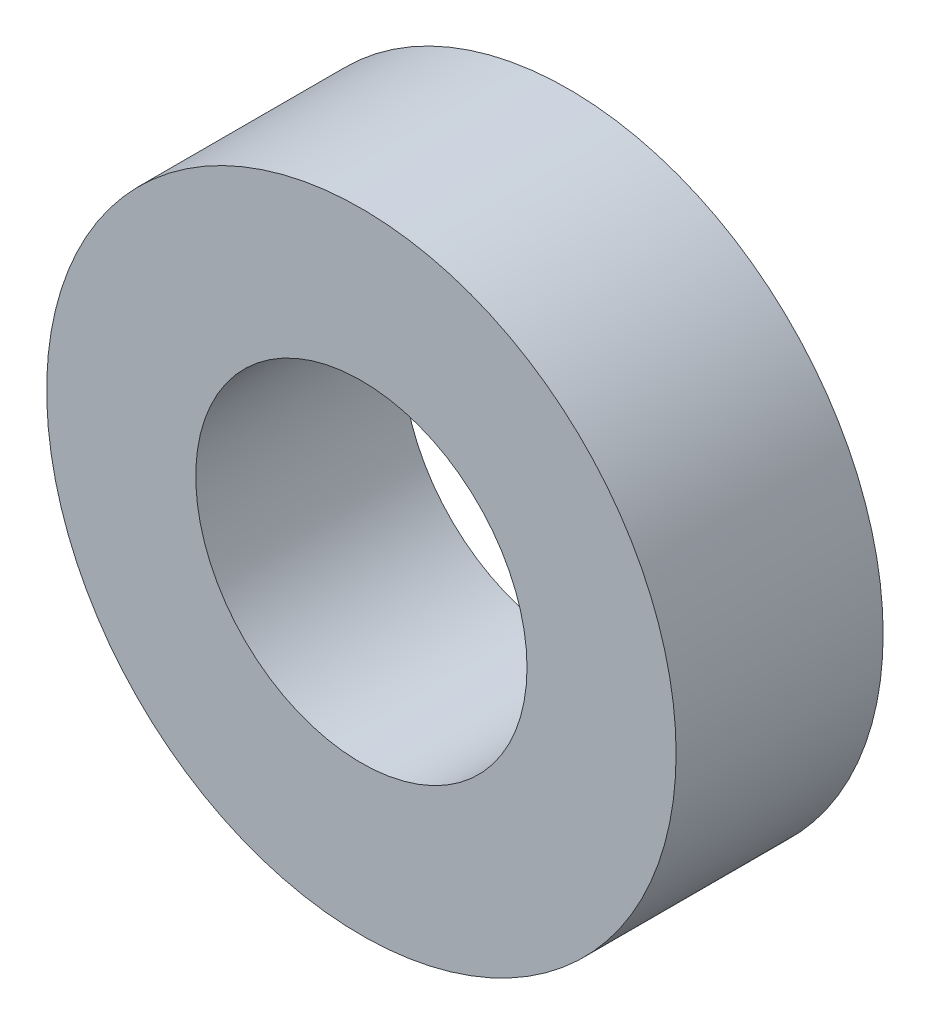
ISO-10303-21;
HEADER;
FILE_DESCRIPTION(('STEP AP214'),'2;1');
FILE_NAME('part.step','',(''),(''),'','','');
FILE_SCHEMA(('AUTOMOTIVE_DESIGN { 1 0 10303 214 1 1 1 1 }'));
ENDSEC;
DATA;
#1=APPLICATION_CONTEXT('core data for automotive mechanical design processes');
#2=APPLICATION_PROTOCOL_DEFINITION('international standard','automotive_design',2000,#1);
#3=PRODUCT_CONTEXT('',#1,'mechanical');
#4=PRODUCT('Part','Part','',(#3));
#5=PRODUCT_RELATED_PRODUCT_CATEGORY('part','',(#4));
#6=PRODUCT_DEFINITION_FORMATION('','',#4);
#7=PRODUCT_DEFINITION_CONTEXT('part definition',#1,'design');
#8=PRODUCT_DEFINITION('design','',#6,#7);
#9=PRODUCT_DEFINITION_SHAPE('','',#8);
#10=(LENGTH_UNIT() NAMED_UNIT(*) SI_UNIT(.MILLI.,.METRE.));
#11=(NAMED_UNIT(*) PLANE_ANGLE_UNIT() SI_UNIT($,.RADIAN.));
#12=(NAMED_UNIT(*) SI_UNIT($,.STERADIAN.) SOLID_ANGLE_UNIT());
#13=UNCERTAINTY_MEASURE_WITH_UNIT(LENGTH_MEASURE(1.E-05),#10,'distance_accuracy_value','');
#14=(GEOMETRIC_REPRESENTATION_CONTEXT(3) GLOBAL_UNCERTAINTY_ASSIGNED_CONTEXT((#13)) GLOBAL_UNIT_ASSIGNED_CONTEXT((#10,
#11,#12)) REPRESENTATION_CONTEXT('',''));
#15=CARTESIAN_POINT('',(0.,0.,0.));
#16=DIRECTION('',(0.,0.,1.));
#17=DIRECTION('',(1.,0.,0.));
#18=AXIS2_PLACEMENT_3D('',#15,#16,#17);
#19=CARTESIAN_POINT('',(0.,0.,1.5625));
#20=DIRECTION('',(0.,0.,1.));
#21=DIRECTION('',(1.,0.,0.));
#22=AXIS2_PLACEMENT_3D('',#19,#20,#21);
#23=PLANE('',#22);
#24=CARTESIAN_POINT('',(0.,0.,1.5625));
#25=DIRECTION('',(0.,0.,1.));
#26=DIRECTION('',(1.,0.,0.));
#27=AXIS2_PLACEMENT_3D('',#24,#25,#26);
#28=CIRCLE('',#27,2.5);
#29=CARTESIAN_POINT('',(2.5,0.,1.5625));
#30=VERTEX_POINT('',#29);
#31=EDGE_CURVE('E25',#30,#30,#28,.F.);
#32=ORIENTED_EDGE('',*,*,#31,.T.);
#33=EDGE_LOOP('',(#32));
#34=FACE_BOUND('',#33,.T.);
#35=CARTESIAN_POINT('',(0.,0.,1.5625));
#36=DIRECTION('',(0.,0.,1.));
#37=DIRECTION('',(1.,0.,0.));
#38=AXIS2_PLACEMENT_3D('',#35,#36,#37);
#39=CIRCLE('',#38,4.75);
#40=CARTESIAN_POINT('',(4.75,0.,1.5625));
#41=VERTEX_POINT('',#40);
#42=EDGE_CURVE('E16',#41,#41,#39,.F.);
#43=ORIENTED_EDGE('',*,*,#42,.F.);
#44=EDGE_LOOP('',(#43));
#45=FACE_BOUND('',#44,.T.);
#46=ADVANCED_FACE('F13',(#34,#45),#23,.T.);
#47=CARTESIAN_POINT('',(0.,0.,-1.5625));
#48=DIRECTION('',(0.,0.,1.));
#49=DIRECTION('',(1.,0.,0.));
#50=AXIS2_PLACEMENT_3D('',#47,#48,#49);
#51=CYLINDRICAL_SURFACE('',#50,4.75);
#52=ORIENTED_EDGE('',*,*,#42,.T.);
#53=EDGE_LOOP('',(#52));
#54=FACE_BOUND('',#53,.T.);
#55=CARTESIAN_POINT('',(0.,0.,-1.5625));
#56=DIRECTION('',(0.,0.,1.));
#57=DIRECTION('',(1.,0.,0.));
#58=AXIS2_PLACEMENT_3D('',#55,#56,#57);
#59=CIRCLE('',#58,4.75);
#60=CARTESIAN_POINT('',(4.75,0.,-1.5625));
#61=VERTEX_POINT('',#60);
#62=EDGE_CURVE('E20',#61,#61,#59,.T.);
#63=ORIENTED_EDGE('',*,*,#62,.T.);
#64=EDGE_LOOP('',(#63));
#65=FACE_BOUND('',#64,.T.);
#66=ADVANCED_FACE('F33',(#54,#65),#51,.T.);
#67=CARTESIAN_POINT('',(0.,0.,-1.5625));
#68=DIRECTION('',(0.,0.,1.));
#69=DIRECTION('',(1.,0.,0.));
#70=AXIS2_PLACEMENT_3D('',#67,#68,#69);
#71=CYLINDRICAL_SURFACE('',#70,2.5);
#72=ORIENTED_EDGE('',*,*,#31,.F.);
#73=EDGE_LOOP('',(#72));
#74=FACE_BOUND('',#73,.T.);
#75=CARTESIAN_POINT('',(0.,0.,-1.5625));
#76=DIRECTION('',(0.,0.,1.));
#77=DIRECTION('',(1.,0.,0.));
#78=AXIS2_PLACEMENT_3D('',#75,#76,#77);
#79=CIRCLE('',#78,2.5);
#80=CARTESIAN_POINT('',(2.5,0.,-1.5625));
#81=VERTEX_POINT('',#80);
#82=EDGE_CURVE('E9',#81,#81,#79,.F.);
#83=ORIENTED_EDGE('',*,*,#82,.T.);
#84=EDGE_LOOP('',(#83));
#85=FACE_BOUND('',#84,.T.);
#86=ADVANCED_FACE('F41',(#74,#85),#71,.F.);
#87=CARTESIAN_POINT('',(0.,0.,-1.5625));
#88=DIRECTION('',(0.,0.,1.));
#89=DIRECTION('',(1.,0.,0.));
#90=AXIS2_PLACEMENT_3D('',#87,#88,#89);
#91=PLANE('',#90);
#92=ORIENTED_EDGE('',*,*,#82,.F.);
#93=EDGE_LOOP('',(#92));
#94=FACE_BOUND('',#93,.T.);
#95=ORIENTED_EDGE('',*,*,#62,.F.);
#96=EDGE_LOOP('',(#95));
#97=FACE_BOUND('',#96,.T.);
#98=ADVANCED_FACE('F42',(#94,#97),#91,.F.);
#99=CLOSED_SHELL('',(#46,#66,#86,#98));
#100=MANIFOLD_SOLID_BREP('B1',#99);
#101=ADVANCED_BREP_SHAPE_REPRESENTATION('',(#18,#100),#14);
#102=SHAPE_DEFINITION_REPRESENTATION(#9,#101);
ENDSEC;
END-ISO-10303-21;
